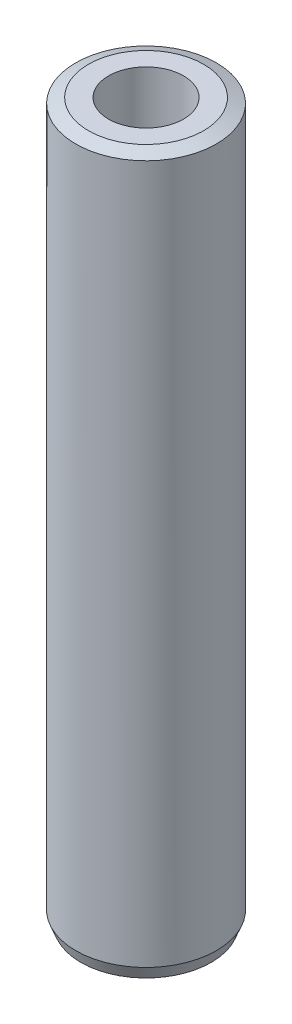
ISO-10303-21;
HEADER;
FILE_DESCRIPTION(('STEP AP214'),'2;1');
FILE_NAME('part.step','',(''),(''),'','','');
FILE_SCHEMA(('AUTOMOTIVE_DESIGN { 1 0 10303 214 1 1 1 1 }'));
ENDSEC;
DATA;
#1=APPLICATION_CONTEXT('core data for automotive mechanical design processes');
#2=APPLICATION_PROTOCOL_DEFINITION('international standard','automotive_design',2000,#1);
#3=PRODUCT_CONTEXT('',#1,'mechanical');
#4=PRODUCT('Part','Part','',(#3));
#5=PRODUCT_RELATED_PRODUCT_CATEGORY('part','',(#4));
#6=PRODUCT_DEFINITION_FORMATION('','',#4);
#7=PRODUCT_DEFINITION_CONTEXT('part definition',#1,'design');
#8=PRODUCT_DEFINITION('design','',#6,#7);
#9=PRODUCT_DEFINITION_SHAPE('','',#8);
#10=(LENGTH_UNIT() NAMED_UNIT(*) SI_UNIT(.MILLI.,.METRE.));
#11=(NAMED_UNIT(*) PLANE_ANGLE_UNIT() SI_UNIT($,.RADIAN.));
#12=(NAMED_UNIT(*) SI_UNIT($,.STERADIAN.) SOLID_ANGLE_UNIT());
#13=UNCERTAINTY_MEASURE_WITH_UNIT(LENGTH_MEASURE(1.E-05),#10,'distance_accuracy_value','');
#14=(GEOMETRIC_REPRESENTATION_CONTEXT(3) GLOBAL_UNCERTAINTY_ASSIGNED_CONTEXT((#13)) GLOBAL_UNIT_ASSIGNED_CONTEXT((#10,
#11,#12)) REPRESENTATION_CONTEXT('',''));
#15=CARTESIAN_POINT('',(0.,0.,0.));
#16=DIRECTION('',(0.,0.,1.));
#17=DIRECTION('',(1.,0.,0.));
#18=AXIS2_PLACEMENT_3D('',#15,#16,#17);
#19=CARTESIAN_POINT('',(0.,127.312840944748,0.));
#20=DIRECTION('',(0.,-1.,0.));
#21=DIRECTION('',(0.,0.,-1.));
#22=AXIS2_PLACEMENT_3D('',#19,#20,#21);
#23=CYLINDRICAL_SURFACE('',#22,12.5);
#24=CARTESIAN_POINT('',(0.,126.407252746842,0.));
#25=DIRECTION('',(0.,1.,0.));
#26=DIRECTION('',(0.,0.,1.));
#27=AXIS2_PLACEMENT_3D('',#24,#25,#26);
#28=CIRCLE('',#27,12.5);
#29=CARTESIAN_POINT('',(0.,126.407252746842,-12.5));
#30=VERTEX_POINT('',#29);
#31=EDGE_CURVE('E50',#30,#30,#28,.F.);
#32=ORIENTED_EDGE('',*,*,#31,.T.);
#33=EDGE_LOOP('',(#32));
#34=FACE_BOUND('',#33,.T.);
#35=CARTESIAN_POINT('',(0.,2.26648366638363,0.));
#36=DIRECTION('',(0.,1.,0.));
#37=DIRECTION('',(0.,0.,1.));
#38=AXIS2_PLACEMENT_3D('',#35,#36,#37);
#39=CIRCLE('',#38,12.5);
#40=CARTESIAN_POINT('',(0.,2.26648366638363,12.5));
#41=VERTEX_POINT('',#40);
#42=EDGE_CURVE('E51',#41,#41,#39,.T.);
#43=ORIENTED_EDGE('',*,*,#42,.T.);
#44=EDGE_LOOP('',(#43));
#45=FACE_BOUND('',#44,.T.);
#46=ADVANCED_FACE('F39',(#34,#45),#23,.T.);
#47=CARTESIAN_POINT('',(0.,127.312840944748,0.));
#48=DIRECTION('',(0.,1.,0.));
#49=DIRECTION('',(0.,0.,1.));
#50=AXIS2_PLACEMENT_3D('',#47,#48,#49);
#51=PLANE('',#50);
#52=CARTESIAN_POINT('',(0.,127.312840944748,0.));
#53=DIRECTION('',(0.,1.,0.));
#54=DIRECTION('',(0.,0.,1.));
#55=AXIS2_PLACEMENT_3D('',#52,#53,#54);
#56=CIRCLE('',#55,10.2335163336163);
#57=CARTESIAN_POINT('',(0.,127.312840944748,-10.2335163336163));
#58=VERTEX_POINT('',#57);
#59=EDGE_CURVE('E54',#58,#58,#56,.T.);
#60=ORIENTED_EDGE('',*,*,#59,.T.);
#61=EDGE_LOOP('',(#60));
#62=FACE_BOUND('',#61,.T.);
#63=CARTESIAN_POINT('',(0.,127.312840944748,0.));
#64=DIRECTION('',(0.,1.,0.));
#65=DIRECTION('',(0.,0.,1.));
#66=AXIS2_PLACEMENT_3D('',#63,#64,#65);
#67=CIRCLE('',#66,6.66516823823594);
#68=CARTESIAN_POINT('',(0.,127.312840944748,6.66516823823594));
#69=VERTEX_POINT('',#68);
#70=EDGE_CURVE('E58',#69,#69,#67,.T.);
#71=ORIENTED_EDGE('',*,*,#70,.F.);
#72=EDGE_LOOP('',(#71));
#73=FACE_BOUND('',#72,.T.);
#74=ADVANCED_FACE('F69',(#62,#73),#51,.T.);
#75=CARTESIAN_POINT('',(0.,0.,0.));
#76=DIRECTION('',(0.,1.,0.));
#77=DIRECTION('',(0.,0.,1.));
#78=AXIS2_PLACEMENT_3D('',#75,#76,#77);
#79=PLANE('',#78);
#80=CARTESIAN_POINT('',(0.,0.,0.));
#81=DIRECTION('',(0.,1.,0.));
#82=DIRECTION('',(0.,0.,1.));
#83=AXIS2_PLACEMENT_3D('',#80,#81,#82);
#84=CIRCLE('',#83,11.5944118020948);
#85=CARTESIAN_POINT('',(0.,0.,11.5944118020948));
#86=VERTEX_POINT('',#85);
#87=EDGE_CURVE('E10',#86,#86,#84,.F.);
#88=ORIENTED_EDGE('',*,*,#87,.T.);
#89=EDGE_LOOP('',(#88));
#90=FACE_BOUND('',#89,.T.);
#91=CARTESIAN_POINT('',(0.,0.,0.));
#92=DIRECTION('',(0.,1.,0.));
#93=DIRECTION('',(0.,0.,1.));
#94=AXIS2_PLACEMENT_3D('',#91,#92,#93);
#95=CIRCLE('',#94,6.66516823823594);
#96=CARTESIAN_POINT('',(0.,0.,6.66516823823594));
#97=VERTEX_POINT('',#96);
#98=EDGE_CURVE('E63',#97,#97,#95,.T.);
#99=ORIENTED_EDGE('',*,*,#98,.T.);
#100=EDGE_LOOP('',(#99));
#101=FACE_BOUND('',#100,.T.);
#102=ADVANCED_FACE('F75',(#90,#101),#79,.F.);
#103=CARTESIAN_POINT('',(0.,127.312840944748,0.));
#104=DIRECTION('',(0.,-1.,0.));
#105=DIRECTION('',(0.,0.,-1.));
#106=AXIS2_PLACEMENT_3D('',#103,#104,#105);
#107=CYLINDRICAL_SURFACE('',#106,6.66516823823594);
#108=ORIENTED_EDGE('',*,*,#70,.T.);
#109=EDGE_LOOP('',(#108));
#110=FACE_BOUND('',#109,.T.);
#111=ORIENTED_EDGE('',*,*,#98,.F.);
#112=EDGE_LOOP('',(#111));
#113=FACE_BOUND('',#112,.T.);
#114=ADVANCED_FACE('F70',(#110,#113),#107,.F.);
#115=CARTESIAN_POINT('',(0.,127.312840944748,0.));
#116=DIRECTION('',(0.,-1.,0.));
#117=DIRECTION('',(0.,0.,-1.));
#118=AXIS2_PLACEMENT_3D('',#115,#116,#117);
#119=CONICAL_SURFACE('',#118,10.2335163336163,1.19067236736204);
#120=CARTESIAN_POINT('',(0.,126.407252746842,-12.5));
#121=CARTESIAN_POINT('',(0.,126.416685957237,-12.4763907951419));
#122=CARTESIAN_POINT('',(0.,126.426119167632,-12.4527815902837));
#123=CARTESIAN_POINT('',(0.,126.444985588422,-12.4055631805674));
#124=CARTESIAN_POINT('',(0.,126.454418798817,-12.3819539757092));
#125=CARTESIAN_POINT('',(0.,126.473285219606,-12.3347355659929));
#126=CARTESIAN_POINT('',(0.,126.482718430001,-12.3111263611347));
#127=CARTESIAN_POINT('',(0.,126.501584850791,-12.2639079514184));
#128=CARTESIAN_POINT('',(0.,126.511018061186,-12.2402987465602));
#129=CARTESIAN_POINT('',(0.,126.529884481975,-12.1930803368439));
#130=CARTESIAN_POINT('',(0.,126.53931769237,-12.1694711319857));
#131=CARTESIAN_POINT('',(0.,126.55818411316,-12.1222527222694));
#132=CARTESIAN_POINT('',(0.,126.567617323555,-12.0986435174113));
#133=CARTESIAN_POINT('',(0.,126.586483744344,-12.0514251076949));
#134=CARTESIAN_POINT('',(0.,126.595916954739,-12.0278159028368));
#135=CARTESIAN_POINT('',(0.,126.614783375529,-11.9805974931204));
#136=CARTESIAN_POINT('',(0.,126.624216585924,-11.9569882882623));
#137=CARTESIAN_POINT('',(0.,126.643083006713,-11.9097698785459));
#138=CARTESIAN_POINT('',(0.,126.652516217108,-11.8861606736878));
#139=CARTESIAN_POINT('',(0.,126.671382637898,-11.8389422639715));
#140=CARTESIAN_POINT('',(0.,126.680815848293,-11.8153330591133));
#141=CARTESIAN_POINT('',(0.,126.699682269083,-11.768114649397));
#142=CARTESIAN_POINT('',(0.,126.709115479477,-11.7445054445388));
#143=CARTESIAN_POINT('',(0.,126.727981900267,-11.6972870348225));
#144=CARTESIAN_POINT('',(0.,126.737415110662,-11.6736778299643));
#145=CARTESIAN_POINT('',(0.,126.756281531452,-11.626459420248));
#146=CARTESIAN_POINT('',(0.,126.765714741846,-11.6028502153898));
#147=CARTESIAN_POINT('',(0.,126.784581162636,-11.5556318056735));
#148=CARTESIAN_POINT('',(0.,126.794014373031,-11.5320226008153));
#149=CARTESIAN_POINT('',(0.,126.812880793821,-11.484804191099));
#150=CARTESIAN_POINT('',(0.,126.822314004216,-11.4611949862408));
#151=CARTESIAN_POINT('',(0.,126.841180425005,-11.4139765765245));
#152=CARTESIAN_POINT('',(0.,126.8506136354,-11.3903673716663));
#153=CARTESIAN_POINT('',(0.,126.86948005619,-11.34314896195));
#154=CARTESIAN_POINT('',(0.,126.878913266585,-11.3195397570919));
#155=CARTESIAN_POINT('',(0.,126.897779687374,-11.2723213473755));
#156=CARTESIAN_POINT('',(0.,126.907212897769,-11.2487121425174));
#157=CARTESIAN_POINT('',(0.,126.926079318559,-11.201493732801));
#158=CARTESIAN_POINT('',(0.,126.935512528954,-11.1778845279429));
#159=CARTESIAN_POINT('',(0.,126.954378949743,-11.1306661182266));
#160=CARTESIAN_POINT('',(0.,126.963812160138,-11.1070569133684));
#161=CARTESIAN_POINT('',(0.,126.982678580928,-11.0598385036521));
#162=CARTESIAN_POINT('',(0.,126.992111791323,-11.0362292987939));
#163=CARTESIAN_POINT('',(0.,127.010978212112,-10.9890108890776));
#164=CARTESIAN_POINT('',(0.,127.020411422507,-10.9654016842194));
#165=CARTESIAN_POINT('',(0.,127.039277843297,-10.9181832745031));
#166=CARTESIAN_POINT('',(0.,127.048711053692,-10.8945740696449));
#167=CARTESIAN_POINT('',(0.,127.067577474482,-10.8473556599286));
#168=CARTESIAN_POINT('',(0.,127.077010684876,-10.8237464550704));
#169=CARTESIAN_POINT('',(0.,127.095877105666,-10.7765280453541));
#170=CARTESIAN_POINT('',(0.,127.105310316061,-10.7529188404959));
#171=CARTESIAN_POINT('',(0.,127.124176736851,-10.7057004307796));
#172=CARTESIAN_POINT('',(0.,127.133609947245,-10.6820912259214));
#173=CARTESIAN_POINT('',(0.,127.152476368035,-10.6348728162051));
#174=CARTESIAN_POINT('',(0.,127.16190957843,-10.611263611347));
#175=CARTESIAN_POINT('',(0.,127.18077599922,-10.5640452016306));
#176=CARTESIAN_POINT('',(0.,127.190209209615,-10.5404359967725));
#177=CARTESIAN_POINT('',(0.,127.209075630404,-10.4932175870561));
#178=CARTESIAN_POINT('',(0.,127.218508840799,-10.469608382198));
#179=CARTESIAN_POINT('',(0.,127.237375261589,-10.4223899724816));
#180=CARTESIAN_POINT('',(0.,127.246808471984,-10.3987807676235));
#181=CARTESIAN_POINT('',(0.,127.265674892773,-10.3515623579072));
#182=CARTESIAN_POINT('',(0.,127.275108103168,-10.327953153049));
#183=CARTESIAN_POINT('',(0.,127.293974523958,-10.2807347433327));
#184=CARTESIAN_POINT('',(0.,127.303407734353,-10.2571255384745));
#185=CARTESIAN_POINT('',(0.,127.312840944748,-10.2335163336163));
#186=B_SPLINE_CURVE_WITH_KNOTS('',3,(#120,#121,#122,#123,#124,#125,#126,#127,#128,#129,#130,
#131,#132,#133,#134,#135,#136,#137,#138,#139,#140,#141,#142,#143,#144,#145,#146,#147,#148,#149,
#150,#151,#152,#153,#154,#155,#156,#157,#158,#159,#160,#161,#162,#163,#164,#165,#166,#167,#168,
#169,#170,#171,#172,#173,#174,#175,#176,#177,#178,#179,#180,#181,#182,#183,#184,#185),
.UNSPECIFIED.,.F.,.F.,(4,2,2,2,2,2,2,2,2,2,2,2,2,2,2,2,2,2,2,2,2,2,2,2,2,2,2,2,2,2,2,2,4),(0.,
0.0762720139467595,0.152544027893507,0.228816041840256,0.305088055787016,0.381360069733765,
0.457632083680513,0.533904097627262,0.610176111574022,0.686448125520771,0.76272013946752,
0.83899215341428,0.915264167361029,0.991536181307777,1.06780819525453,1.14408020920129,
1.22035222314803,1.29662423709478,1.37289625104154,1.44916826498829,1.52544027893504,
1.60171229288179,1.67798430682855,1.7542563207753,1.83052833472205,1.90680034866881,
1.98307236261555,2.0593443765623,2.13561639050905,2.21188840445581,2.28816041840256,
2.36443243234931,2.44070444629607),.UNSPECIFIED.);
#187=EDGE_CURVE('BSEAM81',#30,#58,#186,.T.);
#188=ORIENTED_EDGE('',*,*,#31,.F.);
#189=ORIENTED_EDGE('',*,*,#59,.F.);
#190=ORIENTED_EDGE('',*,*,#187,.T.);
#191=ORIENTED_EDGE('',*,*,#187,.F.);
#192=EDGE_LOOP('',(#188,#190,#189,#191));
#193=FACE_BOUND('',#192,.T.);
#194=ADVANCED_FACE('F81',(#193),#119,.T.);
#195=CARTESIAN_POINT('',(0.,2.26648366638363,0.));
#196=DIRECTION('',(0.,1.,0.));
#197=DIRECTION('',(0.,0.,1.));
#198=AXIS2_PLACEMENT_3D('',#195,#196,#197);
#199=CONICAL_SURFACE('',#198,12.5,0.380123959432855);
#200=ORIENTED_EDGE('',*,*,#87,.F.);
#201=EDGE_LOOP('',(#200));
#202=FACE_BOUND('',#201,.T.);
#203=ORIENTED_EDGE('',*,*,#42,.F.);
#204=EDGE_LOOP('',(#203));
#205=FACE_BOUND('',#204,.T.);
#206=ADVANCED_FACE('F45',(#202,#205),#199,.T.);
#207=CLOSED_SHELL('',(#46,#74,#102,#114,#194,#206));
#208=MANIFOLD_SOLID_BREP('B2',#207);
#209=ADVANCED_BREP_SHAPE_REPRESENTATION('',(#18,#208),#14);
#210=SHAPE_DEFINITION_REPRESENTATION(#9,#209);
ENDSEC;
END-ISO-10303-21;
